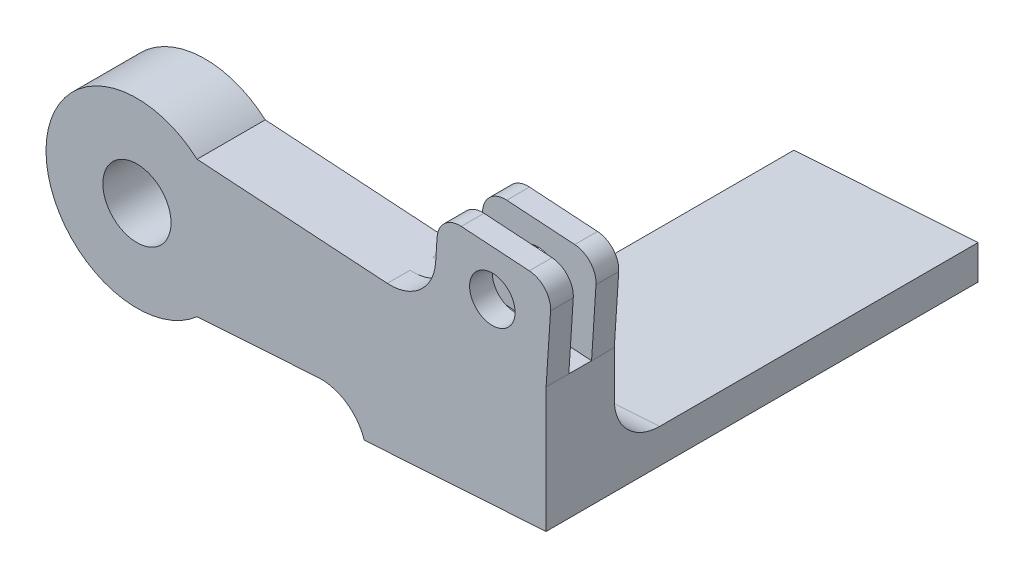
ISO-10303-21;
HEADER;
FILE_DESCRIPTION(('STEP AP214'),'2;1');
FILE_NAME('part.step','',(''),(''),'','','');
FILE_SCHEMA(('AUTOMOTIVE_DESIGN { 1 0 10303 214 1 1 1 1 }'));
ENDSEC;
DATA;
#1=APPLICATION_CONTEXT('core data for automotive mechanical design processes');
#2=APPLICATION_PROTOCOL_DEFINITION('international standard','automotive_design',2000,#1);
#3=PRODUCT_CONTEXT('',#1,'mechanical');
#4=PRODUCT('Part','Part','',(#3));
#5=PRODUCT_RELATED_PRODUCT_CATEGORY('part','',(#4));
#6=PRODUCT_DEFINITION_FORMATION('','',#4);
#7=PRODUCT_DEFINITION_CONTEXT('part definition',#1,'design');
#8=PRODUCT_DEFINITION('design','',#6,#7);
#9=PRODUCT_DEFINITION_SHAPE('','',#8);
#10=(LENGTH_UNIT() NAMED_UNIT(*) SI_UNIT(.MILLI.,.METRE.));
#11=(NAMED_UNIT(*) PLANE_ANGLE_UNIT() SI_UNIT($,.RADIAN.));
#12=(NAMED_UNIT(*) SI_UNIT($,.STERADIAN.) SOLID_ANGLE_UNIT());
#13=UNCERTAINTY_MEASURE_WITH_UNIT(LENGTH_MEASURE(1.E-05),#10,'distance_accuracy_value','');
#14=(GEOMETRIC_REPRESENTATION_CONTEXT(3) GLOBAL_UNCERTAINTY_ASSIGNED_CONTEXT((#13)) GLOBAL_UNIT_ASSIGNED_CONTEXT((#10,
#11,#12)) REPRESENTATION_CONTEXT('',''));
#15=CARTESIAN_POINT('',(0.,0.,0.));
#16=DIRECTION('',(0.,0.,1.));
#17=DIRECTION('',(1.,0.,0.));
#18=AXIS2_PLACEMENT_3D('',#15,#16,#17);
#19=CARTESIAN_POINT('',(13.228756555323,-15.,7.5));
#20=DIRECTION('',(-0.0649908620957342,0.99788585912621,0.));
#21=DIRECTION('',(-0.99788585912621,-0.0649908620957342,0.));
#22=AXIS2_PLACEMENT_3D('',#19,#20,#21);
#23=PLANE('',#22);
#24=DIRECTION('',(0.99788585912621,0.0649908620957342,0.));
#25=VECTOR('',#24,1.);
#26=CARTESIAN_POINT('',(13.228756555323,-15.,-7.5));
#27=LINE('',#26,#25);
#28=CARTESIAN_POINT('',(13.228756555323,-15.,-7.5));
#29=VERTEX_POINT('',#28);
#30=CARTESIAN_POINT('',(39.8454674235298,-13.2664921346893,-7.5));
#31=VERTEX_POINT('',#30);
#32=EDGE_CURVE('E283',#29,#31,#27,.T.);
#33=ORIENTED_EDGE('',*,*,#32,.T.);
#34=DIRECTION('',(0.,0.,1.));
#35=VECTOR('',#34,1.);
#36=CARTESIAN_POINT('',(39.8454674235298,-13.2664921346893,7.5));
#37=LINE('',#36,#35);
#38=CARTESIAN_POINT('',(39.8454674235298,-13.2664921346893,7.5));
#39=VERTEX_POINT('',#38);
#40=EDGE_CURVE('E368',#31,#39,#37,.T.);
#41=ORIENTED_EDGE('',*,*,#40,.T.);
#42=DIRECTION('',(0.99788585912621,0.0649908620957342,0.));
#43=VECTOR('',#42,1.);
#44=CARTESIAN_POINT('',(13.228756555323,-15.,7.5));
#45=LINE('',#44,#43);
#46=CARTESIAN_POINT('',(13.228756555323,-15.,7.5));
#47=VERTEX_POINT('',#46);
#48=EDGE_CURVE('E197',#47,#39,#45,.T.);
#49=ORIENTED_EDGE('',*,*,#48,.F.);
#50=DIRECTION('',(0.,0.,-1.));
#51=VECTOR('',#50,1.);
#52=CARTESIAN_POINT('',(13.228756555323,-15.,7.5));
#53=LINE('',#52,#51);
#54=EDGE_CURVE('E297',#47,#29,#53,.T.);
#55=ORIENTED_EDGE('',*,*,#54,.T.);
#56=EDGE_LOOP('',(#33,#41,#49,#55));
#57=FACE_BOUND('',#56,.T.);
#58=ADVANCED_FACE('F35',(#57),#23,.F.);
#59=CARTESIAN_POINT('',(0.,0.,7.5));
#60=DIRECTION('',(0.,0.,-1.));
#61=DIRECTION('',(-1.,0.,0.));
#62=AXIS2_PLACEMENT_3D('',#59,#60,#61);
#63=CYLINDRICAL_SURFACE('',#62,20.);
#64=ORIENTED_EDGE('',*,*,#54,.F.);
#65=CARTESIAN_POINT('',(0.,0.,7.5));
#66=DIRECTION('',(0.,0.,1.));
#67=DIRECTION('',(1.,0.,0.));
#68=AXIS2_PLACEMENT_3D('',#65,#66,#67);
#69=CIRCLE('',#68,20.);
#70=CARTESIAN_POINT('',(13.228756555323,15.,7.5));
#71=VERTEX_POINT('',#70);
#72=EDGE_CURVE('E307',#71,#47,#69,.T.);
#73=ORIENTED_EDGE('',*,*,#72,.F.);
#74=DIRECTION('',(0.,0.,-1.));
#75=VECTOR('',#74,1.);
#76=CARTESIAN_POINT('',(13.228756555323,15.,7.5));
#77=LINE('',#76,#75);
#78=CARTESIAN_POINT('',(13.228756555323,15.,-7.5));
#79=VERTEX_POINT('',#78);
#80=EDGE_CURVE('E287',#71,#79,#77,.T.);
#81=ORIENTED_EDGE('',*,*,#80,.T.);
#82=CARTESIAN_POINT('',(0.,0.,-7.5));
#83=DIRECTION('',(0.,0.,1.));
#84=DIRECTION('',(1.,0.,0.));
#85=AXIS2_PLACEMENT_3D('',#82,#83,#84);
#86=CIRCLE('',#85,20.);
#87=EDGE_CURVE('E304',#79,#29,#86,.T.);
#88=ORIENTED_EDGE('',*,*,#87,.T.);
#89=EDGE_LOOP('',(#64,#73,#81,#88));
#90=FACE_BOUND('',#89,.T.);
#91=ADVANCED_FACE('F405',(#90),#63,.T.);
#92=CARTESIAN_POINT('',(0.,0.,7.5));
#93=DIRECTION('',(0.,0.,1.));
#94=DIRECTION('',(1.,0.,0.));
#95=AXIS2_PLACEMENT_3D('',#92,#93,#94);
#96=PLANE('',#95);
#97=CARTESIAN_POINT('',(78.1763353818797,20.7912443674588,7.5));
#98=DIRECTION('',(0.,0.,1.));
#99=DIRECTION('',(1.,0.,0.));
#100=AXIS2_PLACEMENT_3D('',#97,#98,#99);
#101=CIRCLE('',#100,5.);
#102=CARTESIAN_POINT('',(83.1763353818797,20.7912443674588,7.5));
#103=VERTEX_POINT('',#102);
#104=EDGE_CURVE('E231',#103,#103,#101,.T.);
#105=ORIENTED_EDGE('',*,*,#104,.F.);
#106=EDGE_LOOP('',(#105));
#107=FACE_BOUND('',#106,.T.);
#108=DIRECTION('',(0.99788585912621,-0.0649908620957343,0.));
#109=VECTOR('',#108,1.);
#110=CARTESIAN_POINT('',(2.32849495852744,35.7522906641627,7.5));
#111=LINE('',#110,#109);
#112=CARTESIAN_POINT('',(71.3421000593905,31.2575344244389,7.5));
#113=VERTEX_POINT('',#112);
#114=CARTESIAN_POINT('',(86.3103879462837,30.2826714930029,7.5));
#115=VERTEX_POINT('',#114);
#116=EDGE_CURVE('E245',#113,#115,#111,.T.);
#117=ORIENTED_EDGE('',*,*,#116,.F.);
#118=CARTESIAN_POINT('',(71.0171457489118,26.2681051288078,7.5));
#119=DIRECTION('',(0.,0.,1.));
#120=DIRECTION('',(1.,0.,0.));
#121=AXIS2_PLACEMENT_3D('',#118,#119,#120);
#122=CIRCLE('',#121,5.);
#123=CARTESIAN_POINT('',(66.0277164532808,26.5930594392865,7.5));
#124=VERTEX_POINT('',#123);
#125=EDGE_CURVE('E327',#113,#124,#122,.T.);
#126=ORIENTED_EDGE('',*,*,#125,.T.);
#127=DIRECTION('',(-0.0649908620957343,-0.99788585912621,0.));
#128=VECTOR('',#127,1.);
#129=CARTESIAN_POINT('',(66.3526707637595,31.5824887349176,7.5));
#130=LINE('',#129,#128);
#131=CARTESIAN_POINT('',(65.7027621428021,21.6036301436554,7.5));
#132=VERTEX_POINT('',#131);
#133=EDGE_CURVE('E254',#124,#132,#130,.T.);
#134=ORIENTED_EDGE('',*,*,#133,.T.);
#135=CARTESIAN_POINT('',(55.72390355154,22.2535387646128,7.5));
#136=DIRECTION('',(0.,0.,1.));
#137=DIRECTION('',(1.,0.,0.));
#138=AXIS2_PLACEMENT_3D('',#135,#136,#137);
#139=CIRCLE('',#138,10.);
#140=CARTESIAN_POINT('',(55.0739949305827,12.2746801733507,7.5));
#141=VERTEX_POINT('',#140);
#142=EDGE_CURVE('E361',#132,#141,#139,.F.);
#143=ORIENTED_EDGE('',*,*,#142,.T.);
#144=DIRECTION('',(-0.99788585912621,0.0649908620957343,0.));
#145=VECTOR('',#144,1.);
#146=CARTESIAN_POINT('',(13.228756555323,15.,7.5));
#147=LINE('',#146,#145);
#148=EDGE_CURVE('E196',#141,#71,#147,.T.);
#149=ORIENTED_EDGE('',*,*,#148,.T.);
#150=ORIENTED_EDGE('',*,*,#72,.T.);
#151=ORIENTED_EDGE('',*,*,#48,.T.);
#152=CARTESIAN_POINT('',(40.4953760444871,-23.2453507259513,7.50000000000001));
#153=DIRECTION('',(0.,0.,1.));
#154=DIRECTION('',(1.,0.,0.));
#155=AXIS2_PLACEMENT_3D('',#152,#153,#154);
#156=CIRCLE('',#155,10.);
#157=CARTESIAN_POINT('',(50.,-20.1369550844201,7.5));
#158=VERTEX_POINT('',#157);
#159=EDGE_CURVE('E214',#39,#158,#156,.F.);
#160=ORIENTED_EDGE('',*,*,#159,.T.);
#161=DIRECTION('',(-0.99788585912621,-0.064990862095734,0.));
#162=VECTOR('',#161,1.);
#163=CARTESIAN_POINT('',(90.,-17.5318129631501,7.5));
#164=LINE('',#163,#162);
#165=CARTESIAN_POINT('',(90.,-17.5318129631501,7.5));
#166=VERTEX_POINT('',#165);
#167=EDGE_CURVE('E203',#166,#158,#164,.T.);
#168=ORIENTED_EDGE('',*,*,#167,.F.);
#169=DIRECTION('',(0.,1.,0.));
#170=VECTOR('',#169,1.);
#171=CARTESIAN_POINT('',(90.,-10.,7.5));
#172=LINE('',#171,#170);
#173=CARTESIAN_POINT('',(90.,9.99999999999999,7.5));
#174=VERTEX_POINT('',#173);
#175=EDGE_CURVE('E185',#166,#174,#172,.T.);
#176=ORIENTED_EDGE('',*,*,#175,.T.);
#177=DIRECTION('',(-0.0649908620957343,-0.99788585912621,0.));
#178=VECTOR('',#177,1.);
#179=CARTESIAN_POINT('',(91.2998172419147,29.9577171825242,7.5));
#180=LINE('',#179,#178);
#181=CARTESIAN_POINT('',(90.974862931436,24.9682878868931,7.5));
#182=VERTEX_POINT('',#181);
#183=EDGE_CURVE('E252',#182,#174,#180,.T.);
#184=ORIENTED_EDGE('',*,*,#183,.F.);
#185=CARTESIAN_POINT('',(85.985433635805,25.2932421973718,7.5));
#186=DIRECTION('',(0.,0.,1.));
#187=DIRECTION('',(1.,0.,0.));
#188=AXIS2_PLACEMENT_3D('',#185,#186,#187);
#189=CIRCLE('',#188,5.);
#190=EDGE_CURVE('E325',#182,#115,#189,.T.);
#191=ORIENTED_EDGE('',*,*,#190,.T.);
#192=EDGE_LOOP('',(#117,#126,#134,#143,#149,#150,#151,#160,#168,#176,#184,#191));
#193=FACE_BOUND('',#192,.T.);
#194=CARTESIAN_POINT('',(0.,0.,7.5));
#195=DIRECTION('',(0.,0.,1.));
#196=DIRECTION('',(1.,0.,0.));
#197=AXIS2_PLACEMENT_3D('',#194,#195,#196);
#198=CIRCLE('',#197,7.5);
#199=CARTESIAN_POINT('',(7.5,0.,7.5));
#200=VERTEX_POINT('',#199);
#201=EDGE_CURVE('E301',#200,#200,#198,.T.);
#202=ORIENTED_EDGE('',*,*,#201,.F.);
#203=EDGE_LOOP('',(#202));
#204=FACE_BOUND('',#203,.T.);
#205=ADVANCED_FACE('F211',(#107,#193,#204),#96,.T.);
#206=CARTESIAN_POINT('',(0.,0.,-7.5));
#207=DIRECTION('',(0.,0.,1.));
#208=DIRECTION('',(1.,0.,0.));
#209=AXIS2_PLACEMENT_3D('',#206,#207,#208);
#210=PLANE('',#209);
#211=CARTESIAN_POINT('',(78.1763353818797,20.7912443674588,-7.5));
#212=DIRECTION('',(0.,0.,1.));
#213=DIRECTION('',(1.,0.,0.));
#214=AXIS2_PLACEMENT_3D('',#211,#212,#213);
#215=CIRCLE('',#214,5.);
#216=CARTESIAN_POINT('',(83.1763353818797,20.7912443674588,-7.5));
#217=VERTEX_POINT('',#216);
#218=EDGE_CURVE('E232',#217,#217,#215,.T.);
#219=ORIENTED_EDGE('',*,*,#218,.T.);
#220=EDGE_LOOP('',(#219));
#221=FACE_BOUND('',#220,.T.);
#222=DIRECTION('',(0.,1.,0.));
#223=VECTOR('',#222,1.);
#224=CARTESIAN_POINT('',(90.,-10.,-7.5));
#225=LINE('',#224,#223);
#226=CARTESIAN_POINT('',(90.,0.0211861993478987,-7.5));
#227=VERTEX_POINT('',#226);
#228=CARTESIAN_POINT('',(90.,9.99999999999999,-7.5));
#229=VERTEX_POINT('',#228);
#230=EDGE_CURVE('E290',#227,#229,#225,.T.);
#231=ORIENTED_EDGE('',*,*,#230,.F.);
#232=DIRECTION('',(0.99788585912621,0.0649908620957341,0.));
#233=VECTOR('',#232,1.);
#234=CARTESIAN_POINT('',(48.8616272313045,-2.65809649315796,-7.5));
#235=LINE('',#234,#233);
#236=CARTESIAN_POINT('',(48.8616272313045,-2.65809649315796,-7.5));
#237=VERTEX_POINT('',#236);
#238=EDGE_CURVE('E378',#227,#237,#235,.F.);
#239=ORIENTED_EDGE('',*,*,#238,.T.);
#240=DIRECTION('',(-0.064990862095737,0.997885859126209,0.));
#241=VECTOR('',#240,1.);
#242=CARTESIAN_POINT('',(48.482858135649,3.15761839721854,-7.5));
#243=LINE('',#242,#241);
#244=CARTESIAN_POINT('',(50.,-20.1369550844201,-7.50000000000001));
#245=VERTEX_POINT('',#244);
#246=EDGE_CURVE('E49',#245,#237,#243,.T.);
#247=ORIENTED_EDGE('',*,*,#246,.F.);
#248=CARTESIAN_POINT('',(40.4953760444871,-23.2453507259513,-7.50000000000001));
#249=DIRECTION('',(0.,0.,1.));
#250=DIRECTION('',(1.,0.,0.));
#251=AXIS2_PLACEMENT_3D('',#248,#249,#250);
#252=CIRCLE('',#251,10.);
#253=EDGE_CURVE('E373',#245,#31,#252,.T.);
#254=ORIENTED_EDGE('',*,*,#253,.T.);
#255=ORIENTED_EDGE('',*,*,#32,.F.);
#256=ORIENTED_EDGE('',*,*,#87,.F.);
#257=DIRECTION('',(-0.99788585912621,0.0649908620957343,0.));
#258=VECTOR('',#257,1.);
#259=CARTESIAN_POINT('',(13.228756555323,15.,-7.5));
#260=LINE('',#259,#258);
#261=CARTESIAN_POINT('',(55.0739949305827,12.2746801733507,-7.5));
#262=VERTEX_POINT('',#261);
#263=EDGE_CURVE('E284',#262,#79,#260,.T.);
#264=ORIENTED_EDGE('',*,*,#263,.F.);
#265=CARTESIAN_POINT('',(55.72390355154,22.2535387646128,-7.5));
#266=DIRECTION('',(0.,0.,1.));
#267=DIRECTION('',(1.,0.,0.));
#268=AXIS2_PLACEMENT_3D('',#265,#266,#267);
#269=CIRCLE('',#268,10.);
#270=CARTESIAN_POINT('',(65.7027621428021,21.6036301436554,-7.5));
#271=VERTEX_POINT('',#270);
#272=EDGE_CURVE('E363',#262,#271,#269,.T.);
#273=ORIENTED_EDGE('',*,*,#272,.T.);
#274=DIRECTION('',(-0.0649908620957343,-0.99788585912621,0.));
#275=VECTOR('',#274,1.);
#276=CARTESIAN_POINT('',(66.3526707637595,31.5824887349176,-7.5));
#277=LINE('',#276,#275);
#278=CARTESIAN_POINT('',(66.0277164532808,26.5930594392865,-7.5));
#279=VERTEX_POINT('',#278);
#280=EDGE_CURVE('E268',#279,#271,#277,.T.);
#281=ORIENTED_EDGE('',*,*,#280,.F.);
#282=CARTESIAN_POINT('',(71.0171457489118,26.2681051288078,-7.5));
#283=DIRECTION('',(0.,0.,1.));
#284=DIRECTION('',(1.,0.,0.));
#285=AXIS2_PLACEMENT_3D('',#282,#283,#284);
#286=CIRCLE('',#285,5.);
#287=CARTESIAN_POINT('',(71.3421000593905,31.2575344244389,-7.5));
#288=VERTEX_POINT('',#287);
#289=EDGE_CURVE('E336',#279,#288,#286,.F.);
#290=ORIENTED_EDGE('',*,*,#289,.T.);
#291=DIRECTION('',(-0.99788585912621,0.0649908620957343,0.));
#292=VECTOR('',#291,1.);
#293=CARTESIAN_POINT('',(2.32849495852744,35.7522906641627,-7.5));
#294=LINE('',#293,#292);
#295=CARTESIAN_POINT('',(86.3103879462837,30.2826714930029,-7.5));
#296=VERTEX_POINT('',#295);
#297=EDGE_CURVE('E264',#296,#288,#294,.T.);
#298=ORIENTED_EDGE('',*,*,#297,.F.);
#299=CARTESIAN_POINT('',(85.985433635805,25.2932421973718,-7.5));
#300=DIRECTION('',(0.,0.,1.));
#301=DIRECTION('',(1.,0.,0.));
#302=AXIS2_PLACEMENT_3D('',#299,#300,#301);
#303=CIRCLE('',#302,5.);
#304=CARTESIAN_POINT('',(90.974862931436,24.9682878868931,-7.5));
#305=VERTEX_POINT('',#304);
#306=EDGE_CURVE('E338',#296,#305,#303,.F.);
#307=ORIENTED_EDGE('',*,*,#306,.T.);
#308=DIRECTION('',(-0.0649908620957343,-0.99788585912621,0.));
#309=VECTOR('',#308,1.);
#310=CARTESIAN_POINT('',(91.2998172419147,29.9577171825242,-7.5));
#311=LINE('',#310,#309);
#312=EDGE_CURVE('E275',#305,#229,#311,.T.);
#313=ORIENTED_EDGE('',*,*,#312,.T.);
#314=EDGE_LOOP('',(#231,#239,#247,#254,#255,#256,#264,#273,#281,#290,#298,#307,#313));
#315=FACE_BOUND('',#314,.T.);
#316=CARTESIAN_POINT('',(0.,0.,-7.5));
#317=DIRECTION('',(0.,0.,1.));
#318=DIRECTION('',(1.,0.,0.));
#319=AXIS2_PLACEMENT_3D('',#316,#317,#318);
#320=CIRCLE('',#319,7.5);
#321=CARTESIAN_POINT('',(7.5,0.,-7.5));
#322=VERTEX_POINT('',#321);
#323=EDGE_CURVE('E300',#322,#322,#320,.T.);
#324=ORIENTED_EDGE('',*,*,#323,.T.);
#325=EDGE_LOOP('',(#324));
#326=FACE_BOUND('',#325,.T.);
#327=ADVANCED_FACE('F382',(#221,#315,#326),#210,.F.);
#328=CARTESIAN_POINT('',(0.,0.,7.5));
#329=DIRECTION('',(0.,0.,-1.));
#330=DIRECTION('',(-1.,0.,0.));
#331=AXIS2_PLACEMENT_3D('',#328,#329,#330);
#332=CYLINDRICAL_SURFACE('',#331,7.5);
#333=ORIENTED_EDGE('',*,*,#201,.T.);
#334=EDGE_LOOP('',(#333));
#335=FACE_BOUND('',#334,.T.);
#336=ORIENTED_EDGE('',*,*,#323,.F.);
#337=EDGE_LOOP('',(#336));
#338=FACE_BOUND('',#337,.T.);
#339=ADVANCED_FACE('F458',(#335,#338),#332,.F.);
#340=CARTESIAN_POINT('',(90.,-10.,7.5));
#341=DIRECTION('',(-1.,0.,0.));
#342=DIRECTION('',(0.,0.,1.));
#343=AXIS2_PLACEMENT_3D('',#340,#341,#342);
#344=PLANE('',#343);
#345=DIRECTION('',(0.,0.,1.));
#346=VECTOR('',#345,1.);
#347=CARTESIAN_POINT('',(90.,-10.,-87.5));
#348=LINE('',#347,#346);
#349=CARTESIAN_POINT('',(90.,-10.,-87.5));
#350=VERTEX_POINT('',#349);
#351=CARTESIAN_POINT('',(90.,-10.,-17.5));
#352=VERTEX_POINT('',#351);
#353=EDGE_CURVE('E207',#350,#352,#348,.T.);
#354=ORIENTED_EDGE('',*,*,#353,.T.);
#355=CARTESIAN_POINT('',(90.,0.0211861993478987,-17.5));
#356=DIRECTION('',(-1.,0.,0.));
#357=DIRECTION('',(0.,-1.,0.));
#358=AXIS2_PLACEMENT_3D('',#355,#356,#357);
#359=ELLIPSE('',#358,10.0211861993479,10.);
#360=EDGE_CURVE('E43',#352,#227,#359,.T.);
#361=ORIENTED_EDGE('',*,*,#360,.T.);
#362=ORIENTED_EDGE('',*,*,#230,.T.);
#363=DIRECTION('',(0.,0.,-1.));
#364=VECTOR('',#363,1.);
#365=CARTESIAN_POINT('',(90.,10.,0.));
#366=LINE('',#365,#364);
#367=CARTESIAN_POINT('',(90.,9.99999999999999,-2.5));
#368=VERTEX_POINT('',#367);
#369=EDGE_CURVE('E265',#368,#229,#366,.T.);
#370=ORIENTED_EDGE('',*,*,#369,.F.);
#371=DIRECTION('',(0.,0.,-1.));
#372=VECTOR('',#371,1.);
#373=CARTESIAN_POINT('',(90.,9.99999999999999,7.5));
#374=LINE('',#373,#372);
#375=CARTESIAN_POINT('',(90.,10.,2.5));
#376=VERTEX_POINT('',#375);
#377=EDGE_CURVE('E295',#376,#368,#374,.T.);
#378=ORIENTED_EDGE('',*,*,#377,.F.);
#379=EDGE_CURVE('E192',#174,#376,#374,.T.);
#380=ORIENTED_EDGE('',*,*,#379,.F.);
#381=ORIENTED_EDGE('',*,*,#175,.F.);
#382=DIRECTION('',(0.,0.,1.));
#383=VECTOR('',#382,1.);
#384=CARTESIAN_POINT('',(90.,-17.5318129631501,-87.5));
#385=LINE('',#384,#383);
#386=CARTESIAN_POINT('',(90.,-17.5318129631501,-87.5));
#387=VERTEX_POINT('',#386);
#388=EDGE_CURVE('E188',#387,#166,#385,.T.);
#389=ORIENTED_EDGE('',*,*,#388,.F.);
#390=DIRECTION('',(0.,-1.,0.));
#391=VECTOR('',#390,1.);
#392=CARTESIAN_POINT('',(90.,-10.,-87.5));
#393=LINE('',#392,#391);
#394=EDGE_CURVE('E218',#350,#387,#393,.T.);
#395=ORIENTED_EDGE('',*,*,#394,.F.);
#396=EDGE_LOOP('',(#354,#361,#362,#370,#378,#380,#381,#389,#395));
#397=FACE_BOUND('',#396,.T.);
#398=ADVANCED_FACE('F187',(#397),#344,.F.);
#399=CARTESIAN_POINT('',(13.228756555323,15.,7.5));
#400=DIRECTION('',(-0.0649908620957343,-0.99788585912621,0.));
#401=DIRECTION('',(0.99788585912621,-0.0649908620957343,0.));
#402=AXIS2_PLACEMENT_3D('',#399,#400,#401);
#403=PLANE('',#402);
#404=ORIENTED_EDGE('',*,*,#148,.F.);
#405=DIRECTION('',(0.,0.,-1.));
#406=VECTOR('',#405,1.);
#407=CARTESIAN_POINT('',(55.0739949305827,12.2746801733507,7.49999999999996));
#408=LINE('',#407,#406);
#409=CARTESIAN_POINT('',(55.0739949305827,12.2746801733507,2.5));
#410=VERTEX_POINT('',#409);
#411=EDGE_CURVE('E352',#141,#410,#408,.T.);
#412=ORIENTED_EDGE('',*,*,#411,.T.);
#413=DIRECTION('',(0.99788585912621,-0.0649908620957343,0.));
#414=VECTOR('',#413,1.);
#415=CARTESIAN_POINT('',(1.02867771661276,15.7945734816385,2.50000000000001));
#416=LINE('',#415,#414);
#417=EDGE_CURVE('E241',#410,#376,#416,.T.);
#418=ORIENTED_EDGE('',*,*,#417,.T.);
#419=ORIENTED_EDGE('',*,*,#377,.T.);
#420=DIRECTION('',(0.99788585912621,-0.0649908620957343,0.));
#421=VECTOR('',#420,1.);
#422=CARTESIAN_POINT('',(1.02867771661276,15.7945734816385,-2.49999999999999));
#423=LINE('',#422,#421);
#424=CARTESIAN_POINT('',(55.0739949305827,12.2746801733507,-2.5));
#425=VERTEX_POINT('',#424);
#426=EDGE_CURVE('E260',#425,#368,#423,.T.);
#427=ORIENTED_EDGE('',*,*,#426,.F.);
#428=DIRECTION('',(0.,0.,-1.));
#429=VECTOR('',#428,1.);
#430=CARTESIAN_POINT('',(55.0739949305827,12.2746801733507,7.49999999999996));
#431=LINE('',#430,#429);
#432=EDGE_CURVE('E349',#425,#262,#431,.T.);
#433=ORIENTED_EDGE('',*,*,#432,.T.);
#434=ORIENTED_EDGE('',*,*,#263,.T.);
#435=ORIENTED_EDGE('',*,*,#80,.F.);
#436=EDGE_LOOP('',(#404,#412,#418,#419,#427,#433,#434,#435));
#437=FACE_BOUND('',#436,.T.);
#438=ADVANCED_FACE('F411',(#437),#403,.F.);
#439=CARTESIAN_POINT('',(66.3526707637594,31.5824887349176,0.));
#440=DIRECTION('',(-0.99788585912621,0.0649908620957343,0.));
#441=DIRECTION('',(-0.0649908620957343,-0.99788585912621,0.));
#442=AXIS2_PLACEMENT_3D('',#439,#440,#441);
#443=PLANE('',#442);
#444=ORIENTED_EDGE('',*,*,#280,.T.);
#445=DIRECTION('',(0.,0.,-1.));
#446=VECTOR('',#445,1.);
#447=CARTESIAN_POINT('',(65.7027621428021,21.6036301436554,0.));
#448=LINE('',#447,#446);
#449=CARTESIAN_POINT('',(65.7027621428021,21.6036301436554,-2.5));
#450=VERTEX_POINT('',#449);
#451=EDGE_CURVE('E357',#271,#450,#448,.F.);
#452=ORIENTED_EDGE('',*,*,#451,.T.);
#453=DIRECTION('',(-0.0649908620957343,-0.99788585912621,0.));
#454=VECTOR('',#453,1.);
#455=CARTESIAN_POINT('',(66.3526707637594,31.5824887349176,-2.5));
#456=LINE('',#455,#454);
#457=CARTESIAN_POINT('',(66.0277164532808,26.5930594392865,-2.5));
#458=VERTEX_POINT('',#457);
#459=EDGE_CURVE('E280',#458,#450,#456,.T.);
#460=ORIENTED_EDGE('',*,*,#459,.F.);
#461=DIRECTION('',(0.,0.,-1.));
#462=VECTOR('',#461,1.);
#463=CARTESIAN_POINT('',(66.0277164532808,26.5930594392865,0.));
#464=LINE('',#463,#462);
#465=EDGE_CURVE('E346',#458,#279,#464,.T.);
#466=ORIENTED_EDGE('',*,*,#465,.T.);
#467=EDGE_LOOP('',(#444,#452,#460,#466));
#468=FACE_BOUND('',#467,.T.);
#469=ADVANCED_FACE('F526',(#468),#443,.T.);
#470=CARTESIAN_POINT('',(2.32849495852744,35.7522906641627,-2.49999999999999));
#471=DIRECTION('',(0.,0.,-1.));
#472=DIRECTION('',(-1.,0.,0.));
#473=AXIS2_PLACEMENT_3D('',#470,#471,#472);
#474=PLANE('',#473);
#475=CARTESIAN_POINT('',(78.1763353818797,20.7912443674588,-2.5));
#476=DIRECTION('',(0.,0.,-1.));
#477=DIRECTION('',(-1.,0.,0.));
#478=AXIS2_PLACEMENT_3D('',#475,#476,#477);
#479=CIRCLE('',#478,5.);
#480=CARTESIAN_POINT('',(73.1763353818797,20.7912443674588,-2.5));
#481=VERTEX_POINT('',#480);
#482=EDGE_CURVE('E238',#481,#481,#479,.T.);
#483=ORIENTED_EDGE('',*,*,#482,.T.);
#484=EDGE_LOOP('',(#483));
#485=FACE_BOUND('',#484,.T.);
#486=DIRECTION('',(-0.0649908620957343,-0.99788585912621,0.));
#487=VECTOR('',#486,1.);
#488=CARTESIAN_POINT('',(91.2998172419147,29.9577171825242,-2.5));
#489=LINE('',#488,#487);
#490=CARTESIAN_POINT('',(90.974862931436,24.9682878868931,-2.5));
#491=VERTEX_POINT('',#490);
#492=EDGE_CURVE('E278',#491,#368,#489,.T.);
#493=ORIENTED_EDGE('',*,*,#492,.F.);
#494=CARTESIAN_POINT('',(85.985433635805,25.2932421973718,-2.5));
#495=DIRECTION('',(0.,0.,-1.));
#496=DIRECTION('',(-1.,0.,0.));
#497=AXIS2_PLACEMENT_3D('',#494,#495,#496);
#498=CIRCLE('',#497,5.);
#499=CARTESIAN_POINT('',(86.3103879462837,30.2826714930029,-2.5));
#500=VERTEX_POINT('',#499);
#501=EDGE_CURVE('E344',#491,#500,#498,.F.);
#502=ORIENTED_EDGE('',*,*,#501,.T.);
#503=DIRECTION('',(0.99788585912621,-0.0649908620957343,0.));
#504=VECTOR('',#503,1.);
#505=CARTESIAN_POINT('',(2.32849495852744,35.7522906641627,-2.49999999999999));
#506=LINE('',#505,#504);
#507=CARTESIAN_POINT('',(71.3421000593905,31.2575344244389,-2.5));
#508=VERTEX_POINT('',#507);
#509=EDGE_CURVE('E261',#508,#500,#506,.T.);
#510=ORIENTED_EDGE('',*,*,#509,.F.);
#511=CARTESIAN_POINT('',(71.0171457489118,26.2681051288078,-2.5));
#512=DIRECTION('',(0.,0.,-1.));
#513=DIRECTION('',(-1.,0.,0.));
#514=AXIS2_PLACEMENT_3D('',#511,#512,#513);
#515=CIRCLE('',#514,5.);
#516=EDGE_CURVE('E342',#508,#458,#515,.F.);
#517=ORIENTED_EDGE('',*,*,#516,.T.);
#518=ORIENTED_EDGE('',*,*,#459,.T.);
#519=CARTESIAN_POINT('',(55.72390355154,22.2535387646128,-2.5));
#520=DIRECTION('',(0.,0.,-1.));
#521=DIRECTION('',(-1.,0.,0.));
#522=AXIS2_PLACEMENT_3D('',#519,#520,#521);
#523=CIRCLE('',#522,10.);
#524=EDGE_CURVE('E365',#450,#425,#523,.T.);
#525=ORIENTED_EDGE('',*,*,#524,.T.);
#526=ORIENTED_EDGE('',*,*,#426,.T.);
#527=EDGE_LOOP('',(#493,#502,#510,#517,#518,#525,#526));
#528=FACE_BOUND('',#527,.T.);
#529=ADVANCED_FACE('F522',(#485,#528),#474,.F.);
#530=CARTESIAN_POINT('',(91.2998172419147,29.9577171825242,0.));
#531=DIRECTION('',(-0.99788585912621,0.0649908620957343,0.));
#532=DIRECTION('',(-0.0649908620957343,-0.99788585912621,0.));
#533=AXIS2_PLACEMENT_3D('',#530,#531,#532);
#534=PLANE('',#533);
#535=ORIENTED_EDGE('',*,*,#312,.F.);
#536=DIRECTION('',(0.,0.,-1.));
#537=VECTOR('',#536,1.);
#538=CARTESIAN_POINT('',(90.974862931436,24.9682878868931,-2.5));
#539=LINE('',#538,#537);
#540=EDGE_CURVE('E340',#305,#491,#539,.F.);
#541=ORIENTED_EDGE('',*,*,#540,.T.);
#542=ORIENTED_EDGE('',*,*,#492,.T.);
#543=ORIENTED_EDGE('',*,*,#369,.T.);
#544=EDGE_LOOP('',(#535,#541,#542,#543));
#545=FACE_BOUND('',#544,.T.);
#546=ADVANCED_FACE('F516',(#545),#534,.F.);
#547=CARTESIAN_POINT('',(2.32849495852744,35.7522906641627,0.));
#548=DIRECTION('',(0.0649908620957343,0.99788585912621,0.));
#549=DIRECTION('',(-0.99788585912621,0.0649908620957343,0.));
#550=AXIS2_PLACEMENT_3D('',#547,#548,#549);
#551=PLANE('',#550);
#552=ORIENTED_EDGE('',*,*,#509,.T.);
#553=DIRECTION('',(0.,0.,-1.));
#554=VECTOR('',#553,1.);
#555=CARTESIAN_POINT('',(86.3103879462837,30.2826714930029,-7.5));
#556=LINE('',#555,#554);
#557=EDGE_CURVE('E333',#500,#296,#556,.T.);
#558=ORIENTED_EDGE('',*,*,#557,.T.);
#559=ORIENTED_EDGE('',*,*,#297,.T.);
#560=DIRECTION('',(0.,0.,-1.));
#561=VECTOR('',#560,1.);
#562=CARTESIAN_POINT('',(71.3421000593905,31.2575344244389,0.));
#563=LINE('',#562,#561);
#564=EDGE_CURVE('E331',#288,#508,#563,.F.);
#565=ORIENTED_EDGE('',*,*,#564,.T.);
#566=EDGE_LOOP('',(#552,#558,#559,#565));
#567=FACE_BOUND('',#566,.T.);
#568=ADVANCED_FACE('F511',(#567),#551,.T.);
#569=CARTESIAN_POINT('',(2.32849495852744,35.7522906641627,2.50000000000001));
#570=DIRECTION('',(0.,0.,-1.));
#571=DIRECTION('',(-1.,0.,0.));
#572=AXIS2_PLACEMENT_3D('',#569,#570,#571);
#573=PLANE('',#572);
#574=CARTESIAN_POINT('',(78.1763353818797,20.7912443674588,2.5));
#575=DIRECTION('',(0.,0.,-1.));
#576=DIRECTION('',(-1.,0.,0.));
#577=AXIS2_PLACEMENT_3D('',#574,#575,#576);
#578=CIRCLE('',#577,5.);
#579=CARTESIAN_POINT('',(73.1763353818797,20.7912443674588,2.5));
#580=VERTEX_POINT('',#579);
#581=EDGE_CURVE('E235',#580,#580,#578,.T.);
#582=ORIENTED_EDGE('',*,*,#581,.F.);
#583=EDGE_LOOP('',(#582));
#584=FACE_BOUND('',#583,.T.);
#585=DIRECTION('',(-0.0649908620957343,-0.99788585912621,0.));
#586=VECTOR('',#585,1.);
#587=CARTESIAN_POINT('',(66.3526707637594,31.5824887349176,2.5));
#588=LINE('',#587,#586);
#589=CARTESIAN_POINT('',(66.0277164532808,26.5930594392865,2.5));
#590=VERTEX_POINT('',#589);
#591=CARTESIAN_POINT('',(65.7027621428021,21.6036301436554,2.5));
#592=VERTEX_POINT('',#591);
#593=EDGE_CURVE('E257',#590,#592,#588,.T.);
#594=ORIENTED_EDGE('',*,*,#593,.F.);
#595=CARTESIAN_POINT('',(71.0171457489118,26.2681051288078,2.5));
#596=DIRECTION('',(0.,0.,-1.));
#597=DIRECTION('',(-1.,0.,0.));
#598=AXIS2_PLACEMENT_3D('',#595,#596,#597);
#599=CIRCLE('',#598,5.);
#600=CARTESIAN_POINT('',(71.3421000593905,31.2575344244389,2.5));
#601=VERTEX_POINT('',#600);
#602=EDGE_CURVE('E318',#590,#601,#599,.T.);
#603=ORIENTED_EDGE('',*,*,#602,.T.);
#604=DIRECTION('',(0.99788585912621,-0.0649908620957343,0.));
#605=VECTOR('',#604,1.);
#606=CARTESIAN_POINT('',(2.32849495852744,35.7522906641627,2.50000000000001));
#607=LINE('',#606,#605);
#608=CARTESIAN_POINT('',(86.3103879462837,30.2826714930029,2.5));
#609=VERTEX_POINT('',#608);
#610=EDGE_CURVE('E242',#601,#609,#607,.T.);
#611=ORIENTED_EDGE('',*,*,#610,.T.);
#612=CARTESIAN_POINT('',(85.985433635805,25.2932421973718,2.5));
#613=DIRECTION('',(0.,0.,-1.));
#614=DIRECTION('',(-1.,0.,0.));
#615=AXIS2_PLACEMENT_3D('',#612,#613,#614);
#616=CIRCLE('',#615,5.);
#617=CARTESIAN_POINT('',(90.974862931436,24.9682878868931,2.5));
#618=VERTEX_POINT('',#617);
#619=EDGE_CURVE('E316',#609,#618,#616,.T.);
#620=ORIENTED_EDGE('',*,*,#619,.T.);
#621=DIRECTION('',(-0.0649908620957343,-0.99788585912621,0.));
#622=VECTOR('',#621,1.);
#623=CARTESIAN_POINT('',(91.2998172419147,29.9577171825242,2.5));
#624=LINE('',#623,#622);
#625=EDGE_CURVE('E248',#618,#376,#624,.T.);
#626=ORIENTED_EDGE('',*,*,#625,.T.);
#627=ORIENTED_EDGE('',*,*,#417,.F.);
#628=CARTESIAN_POINT('',(55.72390355154,22.2535387646128,2.5));
#629=DIRECTION('',(0.,0.,-1.));
#630=DIRECTION('',(-1.,0.,0.));
#631=AXIS2_PLACEMENT_3D('',#628,#629,#630);
#632=CIRCLE('',#631,10.);
#633=EDGE_CURVE('E359',#410,#592,#632,.F.);
#634=ORIENTED_EDGE('',*,*,#633,.T.);
#635=EDGE_LOOP('',(#594,#603,#611,#620,#626,#627,#634));
#636=FACE_BOUND('',#635,.T.);
#637=ADVANCED_FACE('F418',(#584,#636),#573,.T.);
#638=CARTESIAN_POINT('',(66.3526707637594,31.5824887349176,0.));
#639=DIRECTION('',(-0.99788585912621,0.0649908620957343,0.));
#640=DIRECTION('',(-0.0649908620957343,-0.99788585912621,0.));
#641=AXIS2_PLACEMENT_3D('',#638,#639,#640);
#642=PLANE('',#641);
#643=ORIENTED_EDGE('',*,*,#593,.T.);
#644=DIRECTION('',(0.,0.,-1.));
#645=VECTOR('',#644,1.);
#646=CARTESIAN_POINT('',(65.7027621428021,21.6036301436554,0.));
#647=LINE('',#646,#645);
#648=EDGE_CURVE('E355',#592,#132,#647,.F.);
#649=ORIENTED_EDGE('',*,*,#648,.T.);
#650=ORIENTED_EDGE('',*,*,#133,.F.);
#651=DIRECTION('',(0.,0.,-1.));
#652=VECTOR('',#651,1.);
#653=CARTESIAN_POINT('',(66.0277164532808,26.5930594392865,0.));
#654=LINE('',#653,#652);
#655=EDGE_CURVE('E310',#124,#590,#654,.T.);
#656=ORIENTED_EDGE('',*,*,#655,.T.);
#657=EDGE_LOOP('',(#643,#649,#650,#656));
#658=FACE_BOUND('',#657,.T.);
#659=ADVANCED_FACE('F420',(#658),#642,.T.);
#660=CARTESIAN_POINT('',(91.2998172419147,29.9577171825242,0.));
#661=DIRECTION('',(-0.99788585912621,0.0649908620957343,0.));
#662=DIRECTION('',(-0.0649908620957343,-0.99788585912621,0.));
#663=AXIS2_PLACEMENT_3D('',#660,#661,#662);
#664=PLANE('',#663);
#665=ORIENTED_EDGE('',*,*,#625,.F.);
#666=DIRECTION('',(0.,0.,-1.));
#667=VECTOR('',#666,1.);
#668=CARTESIAN_POINT('',(90.974862931436,24.9682878868931,7.5));
#669=LINE('',#668,#667);
#670=EDGE_CURVE('E329',#618,#182,#669,.F.);
#671=ORIENTED_EDGE('',*,*,#670,.T.);
#672=ORIENTED_EDGE('',*,*,#183,.T.);
#673=ORIENTED_EDGE('',*,*,#379,.T.);
#674=EDGE_LOOP('',(#665,#671,#672,#673));
#675=FACE_BOUND('',#674,.T.);
#676=ADVANCED_FACE('F437',(#675),#664,.F.);
#677=CARTESIAN_POINT('',(2.32849495852744,35.7522906641627,0.));
#678=DIRECTION('',(0.0649908620957343,0.99788585912621,0.));
#679=DIRECTION('',(-0.99788585912621,0.0649908620957343,0.));
#680=AXIS2_PLACEMENT_3D('',#677,#678,#679);
#681=PLANE('',#680);
#682=ORIENTED_EDGE('',*,*,#610,.F.);
#683=DIRECTION('',(0.,0.,-1.));
#684=VECTOR('',#683,1.);
#685=CARTESIAN_POINT('',(71.3421000593905,31.2575344244389,0.));
#686=LINE('',#685,#684);
#687=EDGE_CURVE('E323',#601,#113,#686,.F.);
#688=ORIENTED_EDGE('',*,*,#687,.T.);
#689=ORIENTED_EDGE('',*,*,#116,.T.);
#690=DIRECTION('',(0.,0.,-1.));
#691=VECTOR('',#690,1.);
#692=CARTESIAN_POINT('',(86.3103879462837,30.2826714930029,2.5));
#693=LINE('',#692,#691);
#694=EDGE_CURVE('E320',#115,#609,#693,.T.);
#695=ORIENTED_EDGE('',*,*,#694,.T.);
#696=EDGE_LOOP('',(#682,#688,#689,#695));
#697=FACE_BOUND('',#696,.T.);
#698=ADVANCED_FACE('F429',(#697),#681,.T.);
#699=CARTESIAN_POINT('',(78.1763353818797,20.7912443674588,-7.5));
#700=DIRECTION('',(0.,0.,1.));
#701=DIRECTION('',(1.,0.,0.));
#702=AXIS2_PLACEMENT_3D('',#699,#700,#701);
#703=CYLINDRICAL_SURFACE('',#702,5.);
#704=ORIENTED_EDGE('',*,*,#581,.T.);
#705=EDGE_LOOP('',(#704));
#706=FACE_BOUND('',#705,.T.);
#707=ORIENTED_EDGE('',*,*,#104,.T.);
#708=EDGE_LOOP('',(#707));
#709=FACE_BOUND('',#708,.T.);
#710=ADVANCED_FACE('F444',(#706,#709),#703,.F.);
#711=ORIENTED_EDGE('',*,*,#218,.F.);
#712=EDGE_LOOP('',(#711));
#713=FACE_BOUND('',#712,.T.);
#714=ORIENTED_EDGE('',*,*,#482,.F.);
#715=EDGE_LOOP('',(#714));
#716=FACE_BOUND('',#715,.T.);
#717=ADVANCED_FACE('F469',(#713,#716),#703,.F.);
#718=CARTESIAN_POINT('',(71.0171457489118,26.2681051288078,0.));
#719=DIRECTION('',(0.,0.,-1.));
#720=DIRECTION('',(-1.,0.,0.));
#721=AXIS2_PLACEMENT_3D('',#718,#719,#720);
#722=CYLINDRICAL_SURFACE('',#721,5.);
#723=ORIENTED_EDGE('',*,*,#125,.F.);
#724=ORIENTED_EDGE('',*,*,#687,.F.);
#725=ORIENTED_EDGE('',*,*,#602,.F.);
#726=ORIENTED_EDGE('',*,*,#655,.F.);
#727=EDGE_LOOP('',(#723,#724,#725,#726));
#728=FACE_BOUND('',#727,.T.);
#729=ADVANCED_FACE('F425',(#728),#722,.T.);
#730=CARTESIAN_POINT('',(85.985433635805,25.2932421973718,0.));
#731=DIRECTION('',(0.,0.,1.));
#732=DIRECTION('',(0.,-1.,0.));
#733=AXIS2_PLACEMENT_3D('',#730,#731,#732);
#734=CYLINDRICAL_SURFACE('',#733,5.);
#735=ORIENTED_EDGE('',*,*,#190,.F.);
#736=ORIENTED_EDGE('',*,*,#670,.F.);
#737=ORIENTED_EDGE('',*,*,#619,.F.);
#738=ORIENTED_EDGE('',*,*,#694,.F.);
#739=EDGE_LOOP('',(#735,#736,#737,#738));
#740=FACE_BOUND('',#739,.T.);
#741=ADVANCED_FACE('F433',(#740),#734,.T.);
#742=CARTESIAN_POINT('',(85.985433635805,25.2932421973718,0.));
#743=DIRECTION('',(0.,0.,1.));
#744=DIRECTION('',(0.,-1.,0.));
#745=AXIS2_PLACEMENT_3D('',#742,#743,#744);
#746=CYLINDRICAL_SURFACE('',#745,5.);
#747=ORIENTED_EDGE('',*,*,#501,.F.);
#748=ORIENTED_EDGE('',*,*,#540,.F.);
#749=ORIENTED_EDGE('',*,*,#306,.F.);
#750=ORIENTED_EDGE('',*,*,#557,.F.);
#751=EDGE_LOOP('',(#747,#748,#749,#750));
#752=FACE_BOUND('',#751,.T.);
#753=ADVANCED_FACE('F472',(#752),#746,.T.);
#754=CARTESIAN_POINT('',(71.0171457489118,26.2681051288078,0.));
#755=DIRECTION('',(0.,0.,-1.));
#756=DIRECTION('',(-1.,0.,0.));
#757=AXIS2_PLACEMENT_3D('',#754,#755,#756);
#758=CYLINDRICAL_SURFACE('',#757,5.);
#759=ORIENTED_EDGE('',*,*,#516,.F.);
#760=ORIENTED_EDGE('',*,*,#564,.F.);
#761=ORIENTED_EDGE('',*,*,#289,.F.);
#762=ORIENTED_EDGE('',*,*,#465,.F.);
#763=EDGE_LOOP('',(#759,#760,#761,#762));
#764=FACE_BOUND('',#763,.T.);
#765=ADVANCED_FACE('F475',(#764),#758,.T.);
#766=CARTESIAN_POINT('',(55.72390355154,22.2535387646128,7.49999999999996));
#767=DIRECTION('',(0.,0.,-1.));
#768=DIRECTION('',(-1.,0.,0.));
#769=AXIS2_PLACEMENT_3D('',#766,#767,#768);
#770=CYLINDRICAL_SURFACE('',#769,10.);
#771=ORIENTED_EDGE('',*,*,#142,.F.);
#772=ORIENTED_EDGE('',*,*,#648,.F.);
#773=ORIENTED_EDGE('',*,*,#633,.F.);
#774=ORIENTED_EDGE('',*,*,#411,.F.);
#775=EDGE_LOOP('',(#771,#772,#773,#774));
#776=FACE_BOUND('',#775,.T.);
#777=ADVANCED_FACE('F414',(#776),#770,.F.);
#778=CARTESIAN_POINT('',(55.72390355154,22.2535387646128,7.49999999999996));
#779=DIRECTION('',(0.,0.,-1.));
#780=DIRECTION('',(-1.,0.,0.));
#781=AXIS2_PLACEMENT_3D('',#778,#779,#780);
#782=CYLINDRICAL_SURFACE('',#781,10.);
#783=ORIENTED_EDGE('',*,*,#524,.F.);
#784=ORIENTED_EDGE('',*,*,#451,.F.);
#785=ORIENTED_EDGE('',*,*,#272,.F.);
#786=ORIENTED_EDGE('',*,*,#432,.F.);
#787=EDGE_LOOP('',(#783,#784,#785,#786));
#788=FACE_BOUND('',#787,.T.);
#789=ADVANCED_FACE('F482',(#788),#782,.F.);
#790=CARTESIAN_POINT('',(49.5115358522619,-12.6369550844201,-87.5));
#791=DIRECTION('',(0.0649908620957341,-0.99788585912621,0.));
#792=DIRECTION('',(0.99788585912621,0.0649908620957341,0.));
#793=AXIS2_PLACEMENT_3D('',#790,#791,#792);
#794=PLANE('',#793);
#795=DIRECTION('',(0.,0.,1.));
#796=VECTOR('',#795,1.);
#797=CARTESIAN_POINT('',(49.5115358522619,-12.6369550844201,-87.5));
#798=LINE('',#797,#796);
#799=CARTESIAN_POINT('',(49.5115358522619,-12.6369550844201,-87.5));
#800=VERTEX_POINT('',#799);
#801=CARTESIAN_POINT('',(49.5115358522619,-12.6369550844201,-17.5));
#802=VERTEX_POINT('',#801);
#803=EDGE_CURVE('E225',#800,#802,#798,.T.);
#804=ORIENTED_EDGE('',*,*,#803,.T.);
#805=DIRECTION('',(0.99788585912621,0.0649908620957341,0.));
#806=VECTOR('',#805,1.);
#807=CARTESIAN_POINT('',(90.,-10.,-17.5));
#808=LINE('',#807,#806);
#809=EDGE_CURVE('E375',#802,#352,#808,.T.);
#810=ORIENTED_EDGE('',*,*,#809,.T.);
#811=ORIENTED_EDGE('',*,*,#353,.F.);
#812=DIRECTION('',(0.99788585912621,0.0649908620957341,0.));
#813=VECTOR('',#812,1.);
#814=CARTESIAN_POINT('',(49.5115358522619,-12.6369550844201,-87.5));
#815=LINE('',#814,#813);
#816=EDGE_CURVE('E215',#800,#350,#815,.T.);
#817=ORIENTED_EDGE('',*,*,#816,.F.);
#818=EDGE_LOOP('',(#804,#810,#811,#817));
#819=FACE_BOUND('',#818,.T.);
#820=ADVANCED_FACE('F391',(#819),#794,.F.);
#821=CARTESIAN_POINT('',(90.,-17.5318129631501,-87.5));
#822=DIRECTION('',(-0.064990862095734,0.99788585912621,0.));
#823=DIRECTION('',(-0.99788585912621,-0.064990862095734,0.));
#824=AXIS2_PLACEMENT_3D('',#821,#822,#823);
#825=PLANE('',#824);
#826=ORIENTED_EDGE('',*,*,#388,.T.);
#827=ORIENTED_EDGE('',*,*,#167,.T.);
#828=DIRECTION('',(0.,0.,1.));
#829=VECTOR('',#828,1.);
#830=CARTESIAN_POINT('',(50.,-20.1369550844201,-87.5));
#831=LINE('',#830,#829);
#832=EDGE_CURVE('E228',#245,#158,#831,.T.);
#833=ORIENTED_EDGE('',*,*,#832,.F.);
#834=CARTESIAN_POINT('',(50.,-20.1369550844201,-87.5));
#835=VERTEX_POINT('',#834);
#836=EDGE_CURVE('E208',#835,#245,#831,.T.);
#837=ORIENTED_EDGE('',*,*,#836,.F.);
#838=DIRECTION('',(-0.99788585912621,-0.064990862095734,0.));
#839=VECTOR('',#838,1.);
#840=CARTESIAN_POINT('',(90.,-17.5318129631501,-87.5));
#841=LINE('',#840,#839);
#842=EDGE_CURVE('E206',#387,#835,#841,.T.);
#843=ORIENTED_EDGE('',*,*,#842,.F.);
#844=EDGE_LOOP('',(#826,#827,#833,#837,#843));
#845=FACE_BOUND('',#844,.T.);
#846=ADVANCED_FACE('F201',(#845),#825,.F.);
#847=CARTESIAN_POINT('',(50.,-20.1369550844201,-87.5));
#848=DIRECTION('',(0.997885859126209,0.064990862095737,0.));
#849=DIRECTION('',(-0.064990862095737,0.997885859126209,0.));
#850=AXIS2_PLACEMENT_3D('',#847,#848,#849);
#851=PLANE('',#850);
#852=ORIENTED_EDGE('',*,*,#836,.T.);
#853=ORIENTED_EDGE('',*,*,#246,.T.);
#854=CARTESIAN_POINT('',(48.8616272313045,-2.65809649315796,-17.5));
#855=DIRECTION('',(0.997885859126209,0.064990862095737,0.));
#856=DIRECTION('',(-0.064990862095737,0.997885859126209,0.));
#857=AXIS2_PLACEMENT_3D('',#854,#855,#856);
#858=CIRCLE('',#857,10.);
#859=EDGE_CURVE('E11',#237,#802,#858,.T.);
#860=ORIENTED_EDGE('',*,*,#859,.T.);
#861=ORIENTED_EDGE('',*,*,#803,.F.);
#862=DIRECTION('',(-0.064990862095737,0.997885859126209,0.));
#863=VECTOR('',#862,1.);
#864=CARTESIAN_POINT('',(50.,-20.1369550844201,-87.5));
#865=LINE('',#864,#863);
#866=EDGE_CURVE('E223',#835,#800,#865,.T.);
#867=ORIENTED_EDGE('',*,*,#866,.F.);
#868=EDGE_LOOP('',(#852,#853,#860,#861,#867));
#869=FACE_BOUND('',#868,.T.);
#870=ADVANCED_FACE('F387',(#869),#851,.F.);
#871=CARTESIAN_POINT('',(0.,0.,-87.5));
#872=DIRECTION('',(0.,0.,1.));
#873=DIRECTION('',(1.,0.,0.));
#874=AXIS2_PLACEMENT_3D('',#871,#872,#873);
#875=PLANE('',#874);
#876=ORIENTED_EDGE('',*,*,#816,.T.);
#877=ORIENTED_EDGE('',*,*,#394,.T.);
#878=ORIENTED_EDGE('',*,*,#842,.T.);
#879=ORIENTED_EDGE('',*,*,#866,.T.);
#880=EDGE_LOOP('',(#876,#877,#878,#879));
#881=FACE_BOUND('',#880,.T.);
#882=ADVANCED_FACE('F394',(#881),#875,.F.);
#883=CARTESIAN_POINT('',(40.4953760444871,-23.2453507259513,-87.5));
#884=DIRECTION('',(0.,0.,1.));
#885=DIRECTION('',(1.,0.,0.));
#886=AXIS2_PLACEMENT_3D('',#883,#884,#885);
#887=CYLINDRICAL_SURFACE('',#886,10.);
#888=ORIENTED_EDGE('',*,*,#253,.F.);
#889=ORIENTED_EDGE('',*,*,#832,.T.);
#890=ORIENTED_EDGE('',*,*,#159,.F.);
#891=ORIENTED_EDGE('',*,*,#40,.F.);
#892=EDGE_LOOP('',(#888,#889,#890,#891));
#893=FACE_BOUND('',#892,.T.);
#894=ADVANCED_FACE('F398',(#893),#887,.F.);
#895=CARTESIAN_POINT('',(48.8616272313045,-2.65809649315796,-17.5));
#896=DIRECTION('',(-0.99788585912621,-0.0649908620957341,0.));
#897=DIRECTION('',(0.0649908620957341,-0.99788585912621,0.));
#898=AXIS2_PLACEMENT_3D('',#895,#896,#897);
#899=CYLINDRICAL_SURFACE('',#898,10.);
#900=ORIENTED_EDGE('',*,*,#859,.F.);
#901=ORIENTED_EDGE('',*,*,#238,.F.);
#902=ORIENTED_EDGE('',*,*,#360,.F.);
#903=ORIENTED_EDGE('',*,*,#809,.F.);
#904=EDGE_LOOP('',(#900,#901,#902,#903));
#905=FACE_BOUND('',#904,.T.);
#906=ADVANCED_FACE('F37',(#905),#899,.F.);
#907=CLOSED_SHELL('',(#58,#91,#205,#327,#339,#398,#438,#469,#529,#546,#568,#637,#659,#676,#698,
#710,#717,#729,#741,#753,#765,#777,#789,#820,#846,#870,#882,#894,#906));
#908=MANIFOLD_SOLID_BREP('B2',#907);
#909=ADVANCED_BREP_SHAPE_REPRESENTATION('',(#18,#908),#14);
#910=SHAPE_DEFINITION_REPRESENTATION(#9,#909);
ENDSEC;
END-ISO-10303-21;
